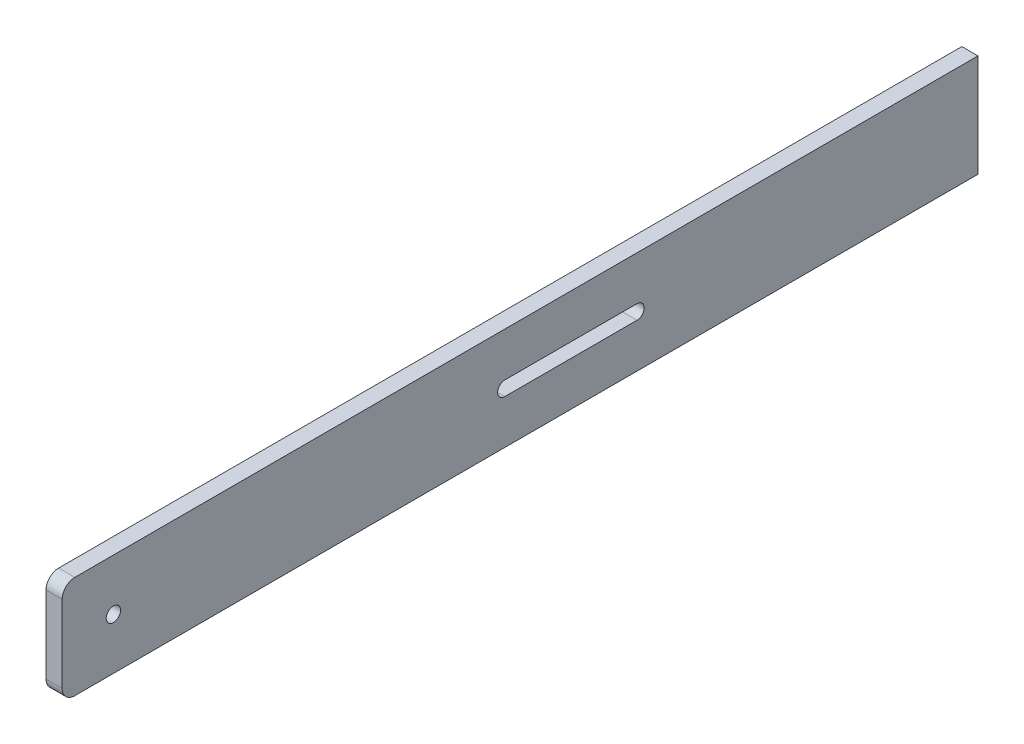
ISO-10303-21;
HEADER;
FILE_DESCRIPTION(('STEP AP214'),'2;1');
FILE_NAME('part.step','',(''),(''),'','','');
FILE_SCHEMA(('AUTOMOTIVE_DESIGN { 1 0 10303 214 1 1 1 1 }'));
ENDSEC;
DATA;
#1=APPLICATION_CONTEXT('core data for automotive mechanical design processes');
#2=APPLICATION_PROTOCOL_DEFINITION('international standard','automotive_design',2000,#1);
#3=PRODUCT_CONTEXT('',#1,'mechanical');
#4=PRODUCT('Part','Part','',(#3));
#5=PRODUCT_RELATED_PRODUCT_CATEGORY('part','',(#4));
#6=PRODUCT_DEFINITION_FORMATION('','',#4);
#7=PRODUCT_DEFINITION_CONTEXT('part definition',#1,'design');
#8=PRODUCT_DEFINITION('design','',#6,#7);
#9=PRODUCT_DEFINITION_SHAPE('','',#8);
#10=(LENGTH_UNIT() NAMED_UNIT(*) SI_UNIT(.MILLI.,.METRE.));
#11=(NAMED_UNIT(*) PLANE_ANGLE_UNIT() SI_UNIT($,.RADIAN.));
#12=(NAMED_UNIT(*) SI_UNIT($,.STERADIAN.) SOLID_ANGLE_UNIT());
#13=UNCERTAINTY_MEASURE_WITH_UNIT(LENGTH_MEASURE(1.E-05),#10,'distance_accuracy_value','');
#14=(GEOMETRIC_REPRESENTATION_CONTEXT(3) GLOBAL_UNCERTAINTY_ASSIGNED_CONTEXT((#13)) GLOBAL_UNIT_ASSIGNED_CONTEXT((#10,
#11,#12)) REPRESENTATION_CONTEXT('',''));
#15=CARTESIAN_POINT('',(0.,0.,0.));
#16=DIRECTION('',(0.,0.,1.));
#17=DIRECTION('',(1.,0.,0.));
#18=AXIS2_PLACEMENT_3D('',#15,#16,#17);
#19=CARTESIAN_POINT('',(1.5875,10.085,180.17));
#20=DIRECTION('',(-1.,0.,0.));
#21=DIRECTION('',(0.,-1.,0.));
#22=AXIS2_PLACEMENT_3D('',#19,#20,#21);
#23=PLANE('',#22);
#24=DIRECTION('',(0.,0.,-1.));
#25=VECTOR('',#24,1.);
#26=CARTESIAN_POINT('',(1.5875,1.415,180.17));
#27=LINE('',#26,#25);
#28=CARTESIAN_POINT('',(1.5875,1.415,93.085));
#29=VERTEX_POINT('',#28);
#30=CARTESIAN_POINT('',(1.5875,1.415,67.085));
#31=VERTEX_POINT('',#30);
#32=EDGE_CURVE('E144',#29,#31,#27,.T.);
#33=ORIENTED_EDGE('',*,*,#32,.T.);
#34=CARTESIAN_POINT('',(1.5875,0.,67.085));
#35=DIRECTION('',(-1.,0.,0.));
#36=DIRECTION('',(0.,-1.,0.));
#37=AXIS2_PLACEMENT_3D('',#34,#35,#36);
#38=CIRCLE('',#37,1.415);
#39=CARTESIAN_POINT('',(1.5875,-1.415,67.085));
#40=VERTEX_POINT('',#39);
#41=EDGE_CURVE('E147',#31,#40,#38,.T.);
#42=ORIENTED_EDGE('',*,*,#41,.T.);
#43=DIRECTION('',(0.,0.,1.));
#44=VECTOR('',#43,1.);
#45=CARTESIAN_POINT('',(1.5875,-1.415,180.17));
#46=LINE('',#45,#44);
#47=CARTESIAN_POINT('',(1.5875,-1.415,93.085));
#48=VERTEX_POINT('',#47);
#49=EDGE_CURVE('E139',#40,#48,#46,.T.);
#50=ORIENTED_EDGE('',*,*,#49,.T.);
#51=CARTESIAN_POINT('',(1.5875,0.,93.085));
#52=DIRECTION('',(-1.,0.,0.));
#53=DIRECTION('',(0.,-1.,0.));
#54=AXIS2_PLACEMENT_3D('',#51,#52,#53);
#55=CIRCLE('',#54,1.415);
#56=EDGE_CURVE('E119',#48,#29,#55,.T.);
#57=ORIENTED_EDGE('',*,*,#56,.T.);
#58=EDGE_LOOP('',(#33,#42,#50,#57));
#59=FACE_BOUND('',#58,.T.);
#60=CARTESIAN_POINT('',(1.5875,0.,170.085));
#61=DIRECTION('',(1.,0.,0.));
#62=DIRECTION('',(0.,0.,-1.));
#63=AXIS2_PLACEMENT_3D('',#60,#61,#62);
#64=CIRCLE('',#63,1.415);
#65=CARTESIAN_POINT('',(1.5875,0.,168.67));
#66=VERTEX_POINT('',#65);
#67=EDGE_CURVE('E150',#66,#66,#64,.T.);
#68=ORIENTED_EDGE('',*,*,#67,.F.);
#69=EDGE_LOOP('',(#68));
#70=FACE_BOUND('',#69,.T.);
#71=DIRECTION('',(0.,1.,0.));
#72=VECTOR('',#71,1.);
#73=CARTESIAN_POINT('',(1.5875,10.085,180.17));
#74=LINE('',#73,#72);
#75=CARTESIAN_POINT('',(1.5875,-7.585,180.17));
#76=VERTEX_POINT('',#75);
#77=CARTESIAN_POINT('',(1.5875,7.585,180.17));
#78=VERTEX_POINT('',#77);
#79=EDGE_CURVE('E157',#76,#78,#74,.T.);
#80=ORIENTED_EDGE('',*,*,#79,.F.);
#81=CARTESIAN_POINT('',(1.5875,-7.585,177.67));
#82=DIRECTION('',(-1.,0.,0.));
#83=DIRECTION('',(0.,-1.,0.));
#84=AXIS2_PLACEMENT_3D('',#81,#82,#83);
#85=CIRCLE('',#84,2.5);
#86=CARTESIAN_POINT('',(1.5875,-10.085,177.67));
#87=VERTEX_POINT('',#86);
#88=EDGE_CURVE('E190',#76,#87,#85,.F.);
#89=ORIENTED_EDGE('',*,*,#88,.T.);
#90=DIRECTION('',(0.,0.,-1.));
#91=VECTOR('',#90,1.);
#92=CARTESIAN_POINT('',(1.5875,-10.085,180.17));
#93=LINE('',#92,#91);
#94=CARTESIAN_POINT('',(1.5875,-10.085,0.));
#95=VERTEX_POINT('',#94);
#96=EDGE_CURVE('E164',#87,#95,#93,.T.);
#97=ORIENTED_EDGE('',*,*,#96,.T.);
#98=DIRECTION('',(0.,1.,0.));
#99=VECTOR('',#98,1.);
#100=CARTESIAN_POINT('',(1.5875,10.085,0.));
#101=LINE('',#100,#99);
#102=CARTESIAN_POINT('',(1.5875,10.085,0.));
#103=VERTEX_POINT('',#102);
#104=EDGE_CURVE('E154',#95,#103,#101,.T.);
#105=ORIENTED_EDGE('',*,*,#104,.T.);
#106=DIRECTION('',(0.,0.,-1.));
#107=VECTOR('',#106,1.);
#108=CARTESIAN_POINT('',(1.5875,10.085,180.17));
#109=LINE('',#108,#107);
#110=CARTESIAN_POINT('',(1.5875,10.085,177.67));
#111=VERTEX_POINT('',#110);
#112=EDGE_CURVE('E180',#111,#103,#109,.T.);
#113=ORIENTED_EDGE('',*,*,#112,.F.);
#114=CARTESIAN_POINT('',(1.5875,7.585,177.67));
#115=DIRECTION('',(-1.,0.,0.));
#116=DIRECTION('',(0.,-1.,0.));
#117=AXIS2_PLACEMENT_3D('',#114,#115,#116);
#118=CIRCLE('',#117,2.5);
#119=EDGE_CURVE('E188',#111,#78,#118,.F.);
#120=ORIENTED_EDGE('',*,*,#119,.T.);
#121=EDGE_LOOP('',(#80,#89,#97,#105,#113,#120));
#122=FACE_BOUND('',#121,.T.);
#123=ADVANCED_FACE('F37',(#59,#70,#122),#23,.F.);
#124=CARTESIAN_POINT('',(-1.5875,10.085,180.17));
#125=DIRECTION('',(0.,-1.,0.));
#126=DIRECTION('',(0.,0.,-1.));
#127=AXIS2_PLACEMENT_3D('',#124,#125,#126);
#128=PLANE('',#127);
#129=DIRECTION('',(0.,0.,-1.));
#130=VECTOR('',#129,1.);
#131=CARTESIAN_POINT('',(-1.5875,10.085,180.17));
#132=LINE('',#131,#130);
#133=CARTESIAN_POINT('',(-1.5875,10.085,177.67));
#134=VERTEX_POINT('',#133);
#135=CARTESIAN_POINT('',(-1.5875,10.085,0.));
#136=VERTEX_POINT('',#135);
#137=EDGE_CURVE('E178',#134,#136,#132,.T.);
#138=ORIENTED_EDGE('',*,*,#137,.F.);
#139=DIRECTION('',(-1.,0.,0.));
#140=VECTOR('',#139,1.);
#141=CARTESIAN_POINT('',(1.5875,10.085,177.67));
#142=LINE('',#141,#140);
#143=EDGE_CURVE('E11',#134,#111,#142,.F.);
#144=ORIENTED_EDGE('',*,*,#143,.T.);
#145=ORIENTED_EDGE('',*,*,#112,.T.);
#146=DIRECTION('',(-1.,0.,0.));
#147=VECTOR('',#146,1.);
#148=CARTESIAN_POINT('',(-1.5875,10.085,0.));
#149=LINE('',#148,#147);
#150=EDGE_CURVE('E167',#103,#136,#149,.T.);
#151=ORIENTED_EDGE('',*,*,#150,.T.);
#152=EDGE_LOOP('',(#138,#144,#145,#151));
#153=FACE_BOUND('',#152,.T.);
#154=ADVANCED_FACE('F223',(#153),#128,.F.);
#155=CARTESIAN_POINT('',(-1.5875,10.085,180.17));
#156=DIRECTION('',(1.,0.,0.));
#157=DIRECTION('',(0.,1.,0.));
#158=AXIS2_PLACEMENT_3D('',#155,#156,#157);
#159=PLANE('',#158);
#160=DIRECTION('',(0.,0.,1.));
#161=VECTOR('',#160,1.);
#162=CARTESIAN_POINT('',(-1.5875,-1.415,67.085));
#163=LINE('',#162,#161);
#164=CARTESIAN_POINT('',(-1.5875,-1.415,67.085));
#165=VERTEX_POINT('',#164);
#166=CARTESIAN_POINT('',(-1.5875,-1.415,93.085));
#167=VERTEX_POINT('',#166);
#168=EDGE_CURVE('E125',#165,#167,#163,.T.);
#169=ORIENTED_EDGE('',*,*,#168,.F.);
#170=CARTESIAN_POINT('',(-1.5875,0.,67.085));
#171=DIRECTION('',(-1.,0.,0.));
#172=DIRECTION('',(0.,-1.,0.));
#173=AXIS2_PLACEMENT_3D('',#170,#171,#172);
#174=CIRCLE('',#173,1.415);
#175=CARTESIAN_POINT('',(-1.5875,1.415,67.085));
#176=VERTEX_POINT('',#175);
#177=EDGE_CURVE('E60',#176,#165,#174,.T.);
#178=ORIENTED_EDGE('',*,*,#177,.F.);
#179=DIRECTION('',(0.,0.,-1.));
#180=VECTOR('',#179,1.);
#181=CARTESIAN_POINT('',(-1.5875,1.415,67.085));
#182=LINE('',#181,#180);
#183=CARTESIAN_POINT('',(-1.5875,1.415,93.085));
#184=VERTEX_POINT('',#183);
#185=EDGE_CURVE('E132',#184,#176,#182,.T.);
#186=ORIENTED_EDGE('',*,*,#185,.F.);
#187=CARTESIAN_POINT('',(-1.5875,0.,93.085));
#188=DIRECTION('',(-1.,0.,0.));
#189=DIRECTION('',(0.,-1.,0.));
#190=AXIS2_PLACEMENT_3D('',#187,#188,#189);
#191=CIRCLE('',#190,1.415);
#192=EDGE_CURVE('E116',#167,#184,#191,.T.);
#193=ORIENTED_EDGE('',*,*,#192,.F.);
#194=EDGE_LOOP('',(#169,#178,#186,#193));
#195=FACE_BOUND('',#194,.T.);
#196=CARTESIAN_POINT('',(-1.5875,0.,170.085));
#197=DIRECTION('',(1.,0.,0.));
#198=DIRECTION('',(0.,0.,-1.));
#199=AXIS2_PLACEMENT_3D('',#196,#197,#198);
#200=CIRCLE('',#199,1.415);
#201=CARTESIAN_POINT('',(-1.5875,0.,168.67));
#202=VERTEX_POINT('',#201);
#203=EDGE_CURVE('E151',#202,#202,#200,.T.);
#204=ORIENTED_EDGE('',*,*,#203,.T.);
#205=EDGE_LOOP('',(#204));
#206=FACE_BOUND('',#205,.T.);
#207=DIRECTION('',(0.,0.,-1.));
#208=VECTOR('',#207,1.);
#209=CARTESIAN_POINT('',(-1.5875,-10.085,180.17));
#210=LINE('',#209,#208);
#211=CARTESIAN_POINT('',(-1.5875,-10.085,177.67));
#212=VERTEX_POINT('',#211);
#213=CARTESIAN_POINT('',(-1.5875,-10.085,0.));
#214=VERTEX_POINT('',#213);
#215=EDGE_CURVE('E176',#212,#214,#210,.T.);
#216=ORIENTED_EDGE('',*,*,#215,.F.);
#217=CARTESIAN_POINT('',(-1.5875,-7.585,177.67));
#218=DIRECTION('',(1.,0.,0.));
#219=DIRECTION('',(0.,1.,0.));
#220=AXIS2_PLACEMENT_3D('',#217,#218,#219);
#221=CIRCLE('',#220,2.5);
#222=CARTESIAN_POINT('',(-1.5875,-7.585,180.17));
#223=VERTEX_POINT('',#222);
#224=EDGE_CURVE('E45',#212,#223,#221,.F.);
#225=ORIENTED_EDGE('',*,*,#224,.T.);
#226=DIRECTION('',(0.,-1.,0.));
#227=VECTOR('',#226,1.);
#228=CARTESIAN_POINT('',(-1.5875,10.085,180.17));
#229=LINE('',#228,#227);
#230=CARTESIAN_POINT('',(-1.5875,7.585,180.17));
#231=VERTEX_POINT('',#230);
#232=EDGE_CURVE('E160',#231,#223,#229,.T.);
#233=ORIENTED_EDGE('',*,*,#232,.F.);
#234=CARTESIAN_POINT('',(-1.5875,7.585,177.67));
#235=DIRECTION('',(1.,0.,0.));
#236=DIRECTION('',(0.,1.,0.));
#237=AXIS2_PLACEMENT_3D('',#234,#235,#236);
#238=CIRCLE('',#237,2.5);
#239=EDGE_CURVE('E194',#231,#134,#238,.F.);
#240=ORIENTED_EDGE('',*,*,#239,.T.);
#241=ORIENTED_EDGE('',*,*,#137,.T.);
#242=DIRECTION('',(0.,-1.,0.));
#243=VECTOR('',#242,1.);
#244=CARTESIAN_POINT('',(-1.5875,10.085,0.));
#245=LINE('',#244,#243);
#246=EDGE_CURVE('E170',#136,#214,#245,.T.);
#247=ORIENTED_EDGE('',*,*,#246,.T.);
#248=EDGE_LOOP('',(#216,#225,#233,#240,#241,#247));
#249=FACE_BOUND('',#248,.T.);
#250=ADVANCED_FACE('F129',(#195,#206,#249),#159,.F.);
#251=CARTESIAN_POINT('',(-1.5875,-10.085,180.17));
#252=DIRECTION('',(0.,1.,0.));
#253=DIRECTION('',(0.,0.,1.));
#254=AXIS2_PLACEMENT_3D('',#251,#252,#253);
#255=PLANE('',#254);
#256=ORIENTED_EDGE('',*,*,#96,.F.);
#257=DIRECTION('',(1.,0.,0.));
#258=VECTOR('',#257,1.);
#259=CARTESIAN_POINT('',(-1.5875,-10.085,177.67));
#260=LINE('',#259,#258);
#261=EDGE_CURVE('E192',#87,#212,#260,.F.);
#262=ORIENTED_EDGE('',*,*,#261,.T.);
#263=ORIENTED_EDGE('',*,*,#215,.T.);
#264=DIRECTION('',(1.,0.,0.));
#265=VECTOR('',#264,1.);
#266=CARTESIAN_POINT('',(-1.5875,-10.085,0.));
#267=LINE('',#266,#265);
#268=EDGE_CURVE('E161',#214,#95,#267,.T.);
#269=ORIENTED_EDGE('',*,*,#268,.T.);
#270=EDGE_LOOP('',(#256,#262,#263,#269));
#271=FACE_BOUND('',#270,.T.);
#272=ADVANCED_FACE('F210',(#271),#255,.F.);
#273=CARTESIAN_POINT('',(0.,0.,180.17));
#274=DIRECTION('',(0.,0.,1.));
#275=DIRECTION('',(1.,0.,0.));
#276=AXIS2_PLACEMENT_3D('',#273,#274,#275);
#277=PLANE('',#276);
#278=ORIENTED_EDGE('',*,*,#232,.T.);
#279=DIRECTION('',(1.,0.,0.));
#280=VECTOR('',#279,1.);
#281=CARTESIAN_POINT('',(1.5875,-7.585,180.17));
#282=LINE('',#281,#280);
#283=EDGE_CURVE('E185',#223,#76,#282,.T.);
#284=ORIENTED_EDGE('',*,*,#283,.T.);
#285=ORIENTED_EDGE('',*,*,#79,.T.);
#286=DIRECTION('',(-1.,0.,0.));
#287=VECTOR('',#286,1.);
#288=CARTESIAN_POINT('',(-1.5875,7.585,180.17));
#289=LINE('',#288,#287);
#290=EDGE_CURVE('E182',#78,#231,#289,.T.);
#291=ORIENTED_EDGE('',*,*,#290,.T.);
#292=EDGE_LOOP('',(#278,#284,#285,#291));
#293=FACE_BOUND('',#292,.T.);
#294=ADVANCED_FACE('F203',(#293),#277,.T.);
#295=CARTESIAN_POINT('',(0.,0.,0.));
#296=DIRECTION('',(0.,0.,1.));
#297=DIRECTION('',(1.,0.,0.));
#298=AXIS2_PLACEMENT_3D('',#295,#296,#297);
#299=PLANE('',#298);
#300=ORIENTED_EDGE('',*,*,#104,.F.);
#301=ORIENTED_EDGE('',*,*,#268,.F.);
#302=ORIENTED_EDGE('',*,*,#246,.F.);
#303=ORIENTED_EDGE('',*,*,#150,.F.);
#304=EDGE_LOOP('',(#300,#301,#302,#303));
#305=FACE_BOUND('',#304,.T.);
#306=ADVANCED_FACE('F216',(#305),#299,.F.);
#307=CARTESIAN_POINT('',(-1.5875,0.,170.085));
#308=DIRECTION('',(1.,0.,0.));
#309=DIRECTION('',(0.,0.,-1.));
#310=AXIS2_PLACEMENT_3D('',#307,#308,#309);
#311=CYLINDRICAL_SURFACE('',#310,1.415);
#312=ORIENTED_EDGE('',*,*,#203,.F.);
#313=EDGE_LOOP('',(#312));
#314=FACE_BOUND('',#313,.T.);
#315=ORIENTED_EDGE('',*,*,#67,.T.);
#316=EDGE_LOOP('',(#315));
#317=FACE_BOUND('',#316,.T.);
#318=ADVANCED_FACE('F235',(#314,#317),#311,.F.);
#319=CARTESIAN_POINT('',(0.,-7.585,177.67));
#320=DIRECTION('',(-1.,0.,0.));
#321=DIRECTION('',(0.,0.,1.));
#322=AXIS2_PLACEMENT_3D('',#319,#320,#321);
#323=CYLINDRICAL_SURFACE('',#322,2.5);
#324=ORIENTED_EDGE('',*,*,#224,.F.);
#325=ORIENTED_EDGE('',*,*,#261,.F.);
#326=ORIENTED_EDGE('',*,*,#88,.F.);
#327=ORIENTED_EDGE('',*,*,#283,.F.);
#328=EDGE_LOOP('',(#324,#325,#326,#327));
#329=FACE_BOUND('',#328,.T.);
#330=ADVANCED_FACE('F206',(#329),#323,.T.);
#331=CARTESIAN_POINT('',(0.,7.585,177.67));
#332=DIRECTION('',(1.,0.,0.));
#333=DIRECTION('',(0.,0.,-1.));
#334=AXIS2_PLACEMENT_3D('',#331,#332,#333);
#335=CYLINDRICAL_SURFACE('',#334,2.5);
#336=ORIENTED_EDGE('',*,*,#119,.F.);
#337=ORIENTED_EDGE('',*,*,#143,.F.);
#338=ORIENTED_EDGE('',*,*,#239,.F.);
#339=ORIENTED_EDGE('',*,*,#290,.F.);
#340=EDGE_LOOP('',(#336,#337,#338,#339));
#341=FACE_BOUND('',#340,.T.);
#342=ADVANCED_FACE('F39',(#341),#335,.T.);
#343=CARTESIAN_POINT('',(8.4125,0.,67.085));
#344=DIRECTION('',(-1.,0.,0.));
#345=DIRECTION('',(0.,-1.,0.));
#346=AXIS2_PLACEMENT_3D('',#343,#344,#345);
#347=CYLINDRICAL_SURFACE('',#346,1.415);
#348=DIRECTION('',(-1.,0.,0.));
#349=VECTOR('',#348,1.);
#350=CARTESIAN_POINT('',(8.4125,1.415,67.085));
#351=LINE('',#350,#349);
#352=EDGE_CURVE('E137',#31,#176,#351,.T.);
#353=ORIENTED_EDGE('',*,*,#352,.T.);
#354=ORIENTED_EDGE('',*,*,#177,.T.);
#355=DIRECTION('',(-1.,0.,0.));
#356=VECTOR('',#355,1.);
#357=CARTESIAN_POINT('',(8.4125,-1.415,67.085));
#358=LINE('',#357,#356);
#359=EDGE_CURVE('E122',#40,#165,#358,.T.);
#360=ORIENTED_EDGE('',*,*,#359,.F.);
#361=ORIENTED_EDGE('',*,*,#41,.F.);
#362=EDGE_LOOP('',(#353,#354,#360,#361));
#363=FACE_BOUND('',#362,.T.);
#364=ADVANCED_FACE('F240',(#363),#347,.F.);
#365=CARTESIAN_POINT('',(8.4125,1.415,67.085));
#366=DIRECTION('',(0.,1.,0.));
#367=DIRECTION('',(-1.,0.,0.));
#368=AXIS2_PLACEMENT_3D('',#365,#366,#367);
#369=PLANE('',#368);
#370=DIRECTION('',(-1.,0.,0.));
#371=VECTOR('',#370,1.);
#372=CARTESIAN_POINT('',(8.4125,1.415,93.085));
#373=LINE('',#372,#371);
#374=EDGE_CURVE('E121',#29,#184,#373,.T.);
#375=ORIENTED_EDGE('',*,*,#374,.T.);
#376=ORIENTED_EDGE('',*,*,#185,.T.);
#377=ORIENTED_EDGE('',*,*,#352,.F.);
#378=ORIENTED_EDGE('',*,*,#32,.F.);
#379=EDGE_LOOP('',(#375,#376,#377,#378));
#380=FACE_BOUND('',#379,.T.);
#381=ADVANCED_FACE('F298',(#380),#369,.F.);
#382=CARTESIAN_POINT('',(8.4125,0.,93.085));
#383=DIRECTION('',(-1.,0.,0.));
#384=DIRECTION('',(0.,-1.,0.));
#385=AXIS2_PLACEMENT_3D('',#382,#383,#384);
#386=CYLINDRICAL_SURFACE('',#385,1.415);
#387=DIRECTION('',(-1.,0.,0.));
#388=VECTOR('',#387,1.);
#389=CARTESIAN_POINT('',(8.4125,-1.415,93.085));
#390=LINE('',#389,#388);
#391=EDGE_CURVE('E52',#48,#167,#390,.T.);
#392=ORIENTED_EDGE('',*,*,#391,.T.);
#393=ORIENTED_EDGE('',*,*,#192,.T.);
#394=ORIENTED_EDGE('',*,*,#374,.F.);
#395=ORIENTED_EDGE('',*,*,#56,.F.);
#396=EDGE_LOOP('',(#392,#393,#394,#395));
#397=FACE_BOUND('',#396,.T.);
#398=ADVANCED_FACE('F113',(#397),#386,.F.);
#399=CARTESIAN_POINT('',(8.4125,-1.415,67.085));
#400=DIRECTION('',(0.,-1.,0.));
#401=DIRECTION('',(1.,0.,0.));
#402=AXIS2_PLACEMENT_3D('',#399,#400,#401);
#403=PLANE('',#402);
#404=ORIENTED_EDGE('',*,*,#359,.T.);
#405=ORIENTED_EDGE('',*,*,#168,.T.);
#406=ORIENTED_EDGE('',*,*,#391,.F.);
#407=ORIENTED_EDGE('',*,*,#49,.F.);
#408=EDGE_LOOP('',(#404,#405,#406,#407));
#409=FACE_BOUND('',#408,.T.);
#410=ADVANCED_FACE('F126',(#409),#403,.F.);
#411=CLOSED_SHELL('',(#123,#154,#250,#272,#294,#306,#318,#330,#342,#364,#381,#398,#410));
#412=MANIFOLD_SOLID_BREP('B2',#411);
#413=ADVANCED_BREP_SHAPE_REPRESENTATION('',(#18,#412),#14);
#414=SHAPE_DEFINITION_REPRESENTATION(#9,#413);
ENDSEC;
END-ISO-10303-21;
